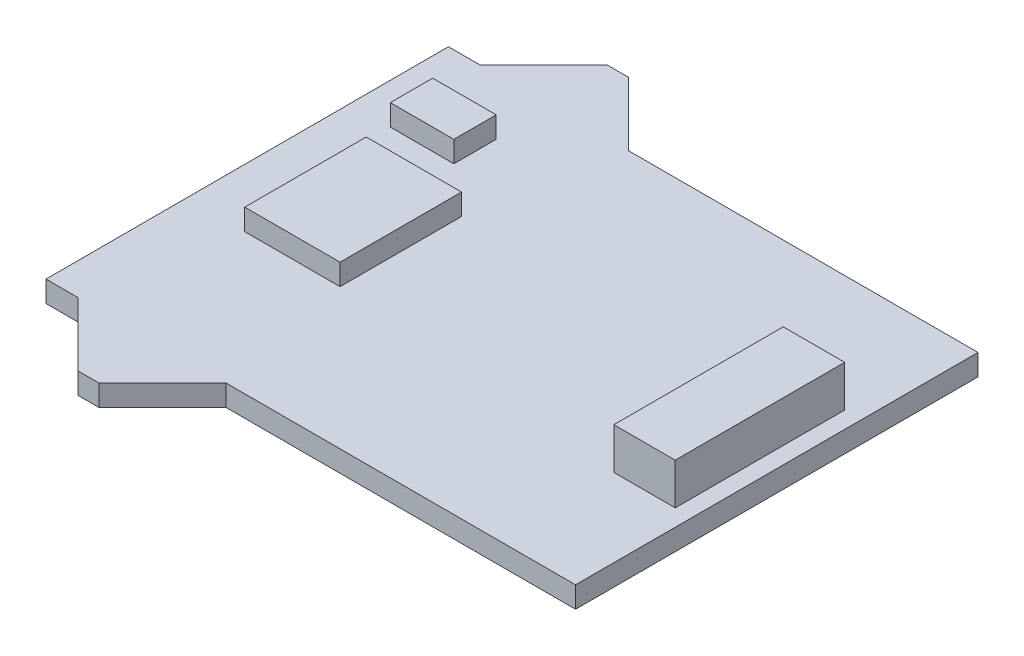
ISO-10303-21;
HEADER;
FILE_DESCRIPTION(('STEP AP214'),'2;1');
FILE_NAME('part.step','',(''),(''),'','','');
FILE_SCHEMA(('AUTOMOTIVE_DESIGN { 1 0 10303 214 1 1 1 1 }'));
ENDSEC;
DATA;
#1=APPLICATION_CONTEXT('core data for automotive mechanical design processes');
#2=APPLICATION_PROTOCOL_DEFINITION('international standard','automotive_design',2000,#1);
#3=PRODUCT_CONTEXT('',#1,'mechanical');
#4=PRODUCT('Part','Part','',(#3));
#5=PRODUCT_RELATED_PRODUCT_CATEGORY('part','',(#4));
#6=PRODUCT_DEFINITION_FORMATION('','',#4);
#7=PRODUCT_DEFINITION_CONTEXT('part definition',#1,'design');
#8=PRODUCT_DEFINITION('design','',#6,#7);
#9=PRODUCT_DEFINITION_SHAPE('','',#8);
#10=(LENGTH_UNIT() NAMED_UNIT(*) SI_UNIT(.MILLI.,.METRE.));
#11=(NAMED_UNIT(*) PLANE_ANGLE_UNIT() SI_UNIT($,.RADIAN.));
#12=(NAMED_UNIT(*) SI_UNIT($,.STERADIAN.) SOLID_ANGLE_UNIT());
#13=UNCERTAINTY_MEASURE_WITH_UNIT(LENGTH_MEASURE(1.E-05),#10,'distance_accuracy_value','');
#14=(GEOMETRIC_REPRESENTATION_CONTEXT(3) GLOBAL_UNCERTAINTY_ASSIGNED_CONTEXT((#13)) GLOBAL_UNIT_ASSIGNED_CONTEXT((#10,
#11,#12)) REPRESENTATION_CONTEXT('',''));
#15=CARTESIAN_POINT('',(0.,0.,0.));
#16=DIRECTION('',(0.,0.,1.));
#17=DIRECTION('',(1.,0.,0.));
#18=AXIS2_PLACEMENT_3D('',#15,#16,#17);
#19=CARTESIAN_POINT('',(0.,0.,0.));
#20=DIRECTION('',(0.,-1.,0.));
#21=DIRECTION('',(0.,0.,-1.));
#22=AXIS2_PLACEMENT_3D('',#19,#20,#21);
#23=PLANE('',#22);
#24=DIRECTION('',(0.,0.,-1.));
#25=VECTOR('',#24,1.);
#26=CARTESIAN_POINT('',(-0.0875000000000005,0.,-4.842));
#27=LINE('',#26,#25);
#28=CARTESIAN_POINT('',(-0.0875000000000005,0.,-4.842));
#29=VERTEX_POINT('',#28);
#30=CARTESIAN_POINT('',(-0.0875000000000008,0.,-6.842));
#31=VERTEX_POINT('',#30);
#32=EDGE_CURVE('E217',#29,#31,#27,.T.);
#33=ORIENTED_EDGE('',*,*,#32,.F.);
#34=DIRECTION('',(1.,0.,0.));
#35=VECTOR('',#34,1.);
#36=CARTESIAN_POINT('',(-3.0875,0.,-4.842));
#37=LINE('',#36,#35);
#38=CARTESIAN_POINT('',(-3.0875,0.,-4.842));
#39=VERTEX_POINT('',#38);
#40=EDGE_CURVE('E230',#39,#29,#37,.T.);
#41=ORIENTED_EDGE('',*,*,#40,.F.);
#42=DIRECTION('',(0.,0.,1.));
#43=VECTOR('',#42,1.);
#44=CARTESIAN_POINT('',(-3.0875,0.,-4.842));
#45=LINE('',#44,#43);
#46=CARTESIAN_POINT('',(-3.0875,0.,-6.842));
#47=VERTEX_POINT('',#46);
#48=EDGE_CURVE('E239',#47,#39,#45,.T.);
#49=ORIENTED_EDGE('',*,*,#48,.F.);
#50=DIRECTION('',(-1.,0.,0.));
#51=VECTOR('',#50,1.);
#52=CARTESIAN_POINT('',(-3.0875,0.,-6.842));
#53=LINE('',#52,#51);
#54=EDGE_CURVE('E220',#31,#47,#53,.T.);
#55=ORIENTED_EDGE('',*,*,#54,.F.);
#56=EDGE_LOOP('',(#33,#41,#49,#55));
#57=FACE_BOUND('',#56,.T.);
#58=DIRECTION('',(0.,0.,-1.));
#59=VECTOR('',#58,1.);
#60=CARTESIAN_POINT('',(20.000000132,0.,-9.50000005));
#61=LINE('',#60,#59);
#62=CARTESIAN_POINT('',(20.000000132,0.,9.50000005));
#63=VERTEX_POINT('',#62);
#64=CARTESIAN_POINT('',(20.000000132,0.,-9.50000005));
#65=VERTEX_POINT('',#64);
#66=EDGE_CURVE('E292',#63,#65,#61,.T.);
#67=ORIENTED_EDGE('',*,*,#66,.T.);
#68=DIRECTION('',(-1.,0.,0.));
#69=VECTOR('',#68,1.);
#70=CARTESIAN_POINT('',(3.499999985,0.,-9.50000005));
#71=LINE('',#70,#69);
#72=CARTESIAN_POINT('',(3.499999985,0.,-9.50000005));
#73=VERTEX_POINT('',#72);
#74=EDGE_CURVE('E288',#65,#73,#71,.T.);
#75=ORIENTED_EDGE('',*,*,#74,.T.);
#76=DIRECTION('',(-0.707106781186547,0.,-0.707106781186547));
#77=VECTOR('',#76,1.);
#78=CARTESIAN_POINT('',(0.499999888999999,0.,-12.500000146));
#79=LINE('',#78,#77);
#80=CARTESIAN_POINT('',(0.499999888999999,0.,-12.500000146));
#81=VERTEX_POINT('',#80);
#82=EDGE_CURVE('E326',#73,#81,#79,.T.);
#83=ORIENTED_EDGE('',*,*,#82,.T.);
#84=DIRECTION('',(-1.,0.,0.));
#85=VECTOR('',#84,1.);
#86=CARTESIAN_POINT('',(-0.499999888999999,0.,-12.500000146));
#87=LINE('',#86,#85);
#88=CARTESIAN_POINT('',(-0.499999888999999,0.,-12.500000146));
#89=VERTEX_POINT('',#88);
#90=EDGE_CURVE('E329',#81,#89,#87,.T.);
#91=ORIENTED_EDGE('',*,*,#90,.T.);
#92=DIRECTION('',(-0.707106781186547,0.,0.707106781186547));
#93=VECTOR('',#92,1.);
#94=CARTESIAN_POINT('',(-3.499999985,0.,-9.50000005));
#95=LINE('',#94,#93);
#96=CARTESIAN_POINT('',(-3.499999985,0.,-9.50000005));
#97=VERTEX_POINT('',#96);
#98=EDGE_CURVE('E332',#89,#97,#95,.T.);
#99=ORIENTED_EDGE('',*,*,#98,.T.);
#100=DIRECTION('',(-1.,0.,0.));
#101=VECTOR('',#100,1.);
#102=CARTESIAN_POINT('',(-4.999999906,0.,-9.50000005));
#103=LINE('',#102,#101);
#104=CARTESIAN_POINT('',(-4.999999906,0.,-9.50000005));
#105=VERTEX_POINT('',#104);
#106=EDGE_CURVE('E335',#97,#105,#103,.T.);
#107=ORIENTED_EDGE('',*,*,#106,.T.);
#108=DIRECTION('',(0.,0.,1.));
#109=VECTOR('',#108,1.);
#110=CARTESIAN_POINT('',(-4.999999906,0.,-9.50000005));
#111=LINE('',#110,#109);
#112=CARTESIAN_POINT('',(-4.999999906,0.,9.50000005));
#113=VERTEX_POINT('',#112);
#114=EDGE_CURVE('E338',#105,#113,#111,.T.);
#115=ORIENTED_EDGE('',*,*,#114,.T.);
#116=DIRECTION('',(1.,0.,0.));
#117=VECTOR('',#116,1.);
#118=CARTESIAN_POINT('',(-4.999999906,0.,9.50000005));
#119=LINE('',#118,#117);
#120=CARTESIAN_POINT('',(-3.499999985,0.,9.50000005));
#121=VERTEX_POINT('',#120);
#122=EDGE_CURVE('E341',#113,#121,#119,.T.);
#123=ORIENTED_EDGE('',*,*,#122,.T.);
#124=DIRECTION('',(0.707106781186547,0.,0.707106781186547));
#125=VECTOR('',#124,1.);
#126=CARTESIAN_POINT('',(-3.499999985,0.,9.50000005));
#127=LINE('',#126,#125);
#128=CARTESIAN_POINT('',(-0.499999888999999,0.,12.500000146));
#129=VERTEX_POINT('',#128);
#130=EDGE_CURVE('E344',#121,#129,#127,.T.);
#131=ORIENTED_EDGE('',*,*,#130,.T.);
#132=DIRECTION('',(1.,0.,0.));
#133=VECTOR('',#132,1.);
#134=CARTESIAN_POINT('',(-0.499999888999999,0.,12.500000146));
#135=LINE('',#134,#133);
#136=CARTESIAN_POINT('',(0.499999888999999,0.,12.500000146));
#137=VERTEX_POINT('',#136);
#138=EDGE_CURVE('E347',#129,#137,#135,.T.);
#139=ORIENTED_EDGE('',*,*,#138,.T.);
#140=DIRECTION('',(0.707106781186547,0.,-0.707106781186547));
#141=VECTOR('',#140,1.);
#142=CARTESIAN_POINT('',(0.499999888999999,0.,12.500000146));
#143=LINE('',#142,#141);
#144=CARTESIAN_POINT('',(3.499999985,0.,9.50000005));
#145=VERTEX_POINT('',#144);
#146=EDGE_CURVE('E350',#137,#145,#143,.T.);
#147=ORIENTED_EDGE('',*,*,#146,.T.);
#148=DIRECTION('',(1.,0.,0.));
#149=VECTOR('',#148,1.);
#150=CARTESIAN_POINT('',(4.999999906,0.,9.50000005));
#151=LINE('',#150,#149);
#152=EDGE_CURVE('E353',#145,#63,#151,.T.);
#153=ORIENTED_EDGE('',*,*,#152,.T.);
#154=EDGE_LOOP('',(#67,#75,#83,#91,#99,#107,#115,#123,#131,#139,#147,#153));
#155=FACE_BOUND('',#154,.T.);
#156=DIRECTION('',(0.,0.,-1.));
#157=VECTOR('',#156,1.);
#158=CARTESIAN_POINT('',(2.249999945,0.,2.86760421207147));
#159=LINE('',#158,#157);
#160=CARTESIAN_POINT('',(2.249999945,0.,2.86760421207147));
#161=VERTEX_POINT('',#160);
#162=CARTESIAN_POINT('',(2.249999945,0.,-2.86760421207147));
#163=VERTEX_POINT('',#162);
#164=EDGE_CURVE('E255',#161,#163,#159,.T.);
#165=ORIENTED_EDGE('',*,*,#164,.F.);
#166=DIRECTION('',(1.,0.,0.));
#167=VECTOR('',#166,1.);
#168=CARTESIAN_POINT('',(-2.249999945,0.,2.86760421207147));
#169=LINE('',#168,#167);
#170=CARTESIAN_POINT('',(-2.249999945,0.,2.86760421207147));
#171=VERTEX_POINT('',#170);
#172=EDGE_CURVE('E260',#171,#161,#169,.T.);
#173=ORIENTED_EDGE('',*,*,#172,.F.);
#174=DIRECTION('',(0.,0.,1.));
#175=VECTOR('',#174,1.);
#176=CARTESIAN_POINT('',(-2.249999945,0.,2.86760421207147));
#177=LINE('',#176,#175);
#178=CARTESIAN_POINT('',(-2.249999945,0.,-2.86760421207147));
#179=VERTEX_POINT('',#178);
#180=EDGE_CURVE('E272',#179,#171,#177,.T.);
#181=ORIENTED_EDGE('',*,*,#180,.F.);
#182=DIRECTION('',(-1.,0.,0.));
#183=VECTOR('',#182,1.);
#184=CARTESIAN_POINT('',(-2.249999945,0.,-2.86760421207147));
#185=LINE('',#184,#183);
#186=EDGE_CURVE('E269',#163,#179,#185,.T.);
#187=ORIENTED_EDGE('',*,*,#186,.F.);
#188=EDGE_LOOP('',(#165,#173,#181,#187));
#189=FACE_BOUND('',#188,.T.);
#190=DIRECTION('',(1.,0.,0.));
#191=VECTOR('',#190,1.);
#192=CARTESIAN_POINT('',(16.30625009,0.,4.000000001));
#193=LINE('',#192,#191);
#194=CARTESIAN_POINT('',(16.30625009,0.,4.000000001));
#195=VERTEX_POINT('',#194);
#196=CARTESIAN_POINT('',(19.206250132,0.,4.000000001));
#197=VERTEX_POINT('',#196);
#198=EDGE_CURVE('E216',#195,#197,#193,.T.);
#199=ORIENTED_EDGE('',*,*,#198,.F.);
#200=DIRECTION('',(0.,0.,1.));
#201=VECTOR('',#200,1.);
#202=CARTESIAN_POINT('',(16.30625009,0.,4.000000001));
#203=LINE('',#202,#201);
#204=CARTESIAN_POINT('',(16.30625009,0.,-4.000000001));
#205=VERTEX_POINT('',#204);
#206=EDGE_CURVE('E213',#205,#195,#203,.T.);
#207=ORIENTED_EDGE('',*,*,#206,.F.);
#208=DIRECTION('',(-1.,0.,0.));
#209=VECTOR('',#208,1.);
#210=CARTESIAN_POINT('',(16.30625009,0.,-4.000000001));
#211=LINE('',#210,#209);
#212=CARTESIAN_POINT('',(19.206250132,0.,-4.000000001));
#213=VERTEX_POINT('',#212);
#214=EDGE_CURVE('E55',#213,#205,#211,.T.);
#215=ORIENTED_EDGE('',*,*,#214,.F.);
#216=DIRECTION('',(0.,0.,-1.));
#217=VECTOR('',#216,1.);
#218=CARTESIAN_POINT('',(19.206250132,0.,4.000000001));
#219=LINE('',#218,#217);
#220=EDGE_CURVE('E50',#197,#213,#219,.T.);
#221=ORIENTED_EDGE('',*,*,#220,.F.);
#222=EDGE_LOOP('',(#199,#207,#215,#221));
#223=FACE_BOUND('',#222,.T.);
#224=ADVANCED_FACE('F33',(#57,#155,#189,#223),#23,.F.);
#225=CARTESIAN_POINT('',(20.000000132,-1.000000032,-9.50000005));
#226=DIRECTION('',(1.,0.,0.));
#227=DIRECTION('',(0.,0.,-1.));
#228=AXIS2_PLACEMENT_3D('',#225,#226,#227);
#229=PLANE('',#228);
#230=ORIENTED_EDGE('',*,*,#66,.F.);
#231=DIRECTION('',(0.,1.,0.));
#232=VECTOR('',#231,1.);
#233=CARTESIAN_POINT('',(20.000000132,-1.000000032,9.50000005));
#234=LINE('',#233,#232);
#235=CARTESIAN_POINT('',(20.000000132,-1.000000032,9.50000005));
#236=VERTEX_POINT('',#235);
#237=EDGE_CURVE('E42',#236,#63,#234,.T.);
#238=ORIENTED_EDGE('',*,*,#237,.F.);
#239=DIRECTION('',(0.,0.,-1.));
#240=VECTOR('',#239,1.);
#241=CARTESIAN_POINT('',(20.000000132,-1.000000032,-9.50000005));
#242=LINE('',#241,#240);
#243=CARTESIAN_POINT('',(20.000000132,-1.000000032,-9.50000005));
#244=VERTEX_POINT('',#243);
#245=EDGE_CURVE('E321',#236,#244,#242,.T.);
#246=ORIENTED_EDGE('',*,*,#245,.T.);
#247=DIRECTION('',(0.,1.,0.));
#248=VECTOR('',#247,1.);
#249=CARTESIAN_POINT('',(20.000000132,-1.000000032,-9.50000005));
#250=LINE('',#249,#248);
#251=EDGE_CURVE('E11',#244,#65,#250,.T.);
#252=ORIENTED_EDGE('',*,*,#251,.T.);
#253=EDGE_LOOP('',(#230,#238,#246,#252));
#254=FACE_BOUND('',#253,.T.);
#255=ADVANCED_FACE('F389',(#254),#229,.T.);
#256=CARTESIAN_POINT('',(4.999999906,-1.000000032,9.50000005));
#257=DIRECTION('',(0.,0.,1.));
#258=DIRECTION('',(1.,0.,0.));
#259=AXIS2_PLACEMENT_3D('',#256,#257,#258);
#260=PLANE('',#259);
#261=ORIENTED_EDGE('',*,*,#152,.F.);
#262=DIRECTION('',(0.,1.,0.));
#263=VECTOR('',#262,1.);
#264=CARTESIAN_POINT('',(3.499999985,-1.000000032,9.50000005));
#265=LINE('',#264,#263);
#266=CARTESIAN_POINT('',(3.499999985,-1.000000032,9.50000005));
#267=VERTEX_POINT('',#266);
#268=EDGE_CURVE('E359',#267,#145,#265,.T.);
#269=ORIENTED_EDGE('',*,*,#268,.F.);
#270=DIRECTION('',(1.,0.,0.));
#271=VECTOR('',#270,1.);
#272=CARTESIAN_POINT('',(3.499999985,-1.000000032,9.50000005));
#273=LINE('',#272,#271);
#274=EDGE_CURVE('E319',#267,#236,#273,.T.);
#275=ORIENTED_EDGE('',*,*,#274,.T.);
#276=ORIENTED_EDGE('',*,*,#237,.T.);
#277=EDGE_LOOP('',(#261,#269,#275,#276));
#278=FACE_BOUND('',#277,.T.);
#279=ADVANCED_FACE('F426',(#278),#260,.T.);
#280=CARTESIAN_POINT('',(0.499999888999999,-1.000000032,12.500000146));
#281=DIRECTION('',(0.707106781186547,0.,0.707106781186548));
#282=DIRECTION('',(0.707106781186548,0.,-0.707106781186547));
#283=AXIS2_PLACEMENT_3D('',#280,#281,#282);
#284=PLANE('',#283);
#285=ORIENTED_EDGE('',*,*,#146,.F.);
#286=DIRECTION('',(0.,1.,0.));
#287=VECTOR('',#286,1.);
#288=CARTESIAN_POINT('',(0.499999888999999,-1.000000032,12.500000146));
#289=LINE('',#288,#287);
#290=CARTESIAN_POINT('',(0.499999888999999,-1.000000032,12.500000146));
#291=VERTEX_POINT('',#290);
#292=EDGE_CURVE('E362',#291,#137,#289,.T.);
#293=ORIENTED_EDGE('',*,*,#292,.F.);
#294=DIRECTION('',(0.707106781186547,0.,-0.707106781186547));
#295=VECTOR('',#294,1.);
#296=CARTESIAN_POINT('',(0.499999888999999,-1.000000032,12.500000146));
#297=LINE('',#296,#295);
#298=EDGE_CURVE('E316',#291,#267,#297,.T.);
#299=ORIENTED_EDGE('',*,*,#298,.T.);
#300=ORIENTED_EDGE('',*,*,#268,.T.);
#301=EDGE_LOOP('',(#285,#293,#299,#300));
#302=FACE_BOUND('',#301,.T.);
#303=ADVANCED_FACE('F423',(#302),#284,.T.);
#304=CARTESIAN_POINT('',(-0.499999888999999,-1.000000032,12.500000146));
#305=DIRECTION('',(0.,0.,1.));
#306=DIRECTION('',(1.,0.,0.));
#307=AXIS2_PLACEMENT_3D('',#304,#305,#306);
#308=PLANE('',#307);
#309=ORIENTED_EDGE('',*,*,#138,.F.);
#310=DIRECTION('',(0.,1.,0.));
#311=VECTOR('',#310,1.);
#312=CARTESIAN_POINT('',(-0.499999888999999,-1.000000032,12.500000146));
#313=LINE('',#312,#311);
#314=CARTESIAN_POINT('',(-0.499999888999999,-1.000000032,12.500000146));
#315=VERTEX_POINT('',#314);
#316=EDGE_CURVE('E364',#315,#129,#313,.T.);
#317=ORIENTED_EDGE('',*,*,#316,.F.);
#318=DIRECTION('',(1.,0.,0.));
#319=VECTOR('',#318,1.);
#320=CARTESIAN_POINT('',(-0.499999888999999,-1.000000032,12.500000146));
#321=LINE('',#320,#319);
#322=EDGE_CURVE('E313',#315,#291,#321,.T.);
#323=ORIENTED_EDGE('',*,*,#322,.T.);
#324=ORIENTED_EDGE('',*,*,#292,.T.);
#325=EDGE_LOOP('',(#309,#317,#323,#324));
#326=FACE_BOUND('',#325,.T.);
#327=ADVANCED_FACE('F420',(#326),#308,.T.);
#328=CARTESIAN_POINT('',(-3.499999985,-1.000000032,9.50000005));
#329=DIRECTION('',(-0.707106781186547,0.,0.707106781186548));
#330=DIRECTION('',(0.707106781186548,0.,0.707106781186547));
#331=AXIS2_PLACEMENT_3D('',#328,#329,#330);
#332=PLANE('',#331);
#333=ORIENTED_EDGE('',*,*,#130,.F.);
#334=DIRECTION('',(0.,1.,0.));
#335=VECTOR('',#334,1.);
#336=CARTESIAN_POINT('',(-3.499999985,-1.000000032,9.50000005));
#337=LINE('',#336,#335);
#338=CARTESIAN_POINT('',(-3.499999985,-1.000000032,9.50000005));
#339=VERTEX_POINT('',#338);
#340=EDGE_CURVE('E366',#339,#121,#337,.T.);
#341=ORIENTED_EDGE('',*,*,#340,.F.);
#342=DIRECTION('',(0.707106781186547,0.,0.707106781186547));
#343=VECTOR('',#342,1.);
#344=CARTESIAN_POINT('',(-3.499999985,-1.000000032,9.50000005));
#345=LINE('',#344,#343);
#346=EDGE_CURVE('E310',#339,#315,#345,.T.);
#347=ORIENTED_EDGE('',*,*,#346,.T.);
#348=ORIENTED_EDGE('',*,*,#316,.T.);
#349=EDGE_LOOP('',(#333,#341,#347,#348));
#350=FACE_BOUND('',#349,.T.);
#351=ADVANCED_FACE('F416',(#350),#332,.T.);
#352=CARTESIAN_POINT('',(-4.999999906,-1.000000032,9.50000005));
#353=DIRECTION('',(0.,0.,1.));
#354=DIRECTION('',(1.,0.,0.));
#355=AXIS2_PLACEMENT_3D('',#352,#353,#354);
#356=PLANE('',#355);
#357=ORIENTED_EDGE('',*,*,#122,.F.);
#358=DIRECTION('',(0.,1.,0.));
#359=VECTOR('',#358,1.);
#360=CARTESIAN_POINT('',(-4.999999906,-1.000000032,9.50000005));
#361=LINE('',#360,#359);
#362=CARTESIAN_POINT('',(-4.999999906,-1.000000032,9.50000005));
#363=VERTEX_POINT('',#362);
#364=EDGE_CURVE('E368',#363,#113,#361,.T.);
#365=ORIENTED_EDGE('',*,*,#364,.F.);
#366=DIRECTION('',(1.,0.,0.));
#367=VECTOR('',#366,1.);
#368=CARTESIAN_POINT('',(-4.999999906,-1.000000032,9.50000005));
#369=LINE('',#368,#367);
#370=EDGE_CURVE('E307',#363,#339,#369,.T.);
#371=ORIENTED_EDGE('',*,*,#370,.T.);
#372=ORIENTED_EDGE('',*,*,#340,.T.);
#373=EDGE_LOOP('',(#357,#365,#371,#372));
#374=FACE_BOUND('',#373,.T.);
#375=ADVANCED_FACE('F412',(#374),#356,.T.);
#376=CARTESIAN_POINT('',(-4.999999906,-1.000000032,-9.50000005));
#377=DIRECTION('',(-1.,0.,0.));
#378=DIRECTION('',(0.,0.,1.));
#379=AXIS2_PLACEMENT_3D('',#376,#377,#378);
#380=PLANE('',#379);
#381=ORIENTED_EDGE('',*,*,#114,.F.);
#382=DIRECTION('',(0.,1.,0.));
#383=VECTOR('',#382,1.);
#384=CARTESIAN_POINT('',(-4.999999906,-1.000000032,-9.50000005));
#385=LINE('',#384,#383);
#386=CARTESIAN_POINT('',(-4.999999906,-1.000000032,-9.50000005));
#387=VERTEX_POINT('',#386);
#388=EDGE_CURVE('E370',#387,#105,#385,.T.);
#389=ORIENTED_EDGE('',*,*,#388,.F.);
#390=DIRECTION('',(0.,0.,1.));
#391=VECTOR('',#390,1.);
#392=CARTESIAN_POINT('',(-4.999999906,-1.000000032,-9.50000005));
#393=LINE('',#392,#391);
#394=EDGE_CURVE('E304',#387,#363,#393,.T.);
#395=ORIENTED_EDGE('',*,*,#394,.T.);
#396=ORIENTED_EDGE('',*,*,#364,.T.);
#397=EDGE_LOOP('',(#381,#389,#395,#396));
#398=FACE_BOUND('',#397,.T.);
#399=ADVANCED_FACE('F408',(#398),#380,.T.);
#400=CARTESIAN_POINT('',(-4.999999906,-1.000000032,-9.50000005));
#401=DIRECTION('',(0.,0.,-1.));
#402=DIRECTION('',(-1.,0.,0.));
#403=AXIS2_PLACEMENT_3D('',#400,#401,#402);
#404=PLANE('',#403);
#405=ORIENTED_EDGE('',*,*,#106,.F.);
#406=DIRECTION('',(0.,1.,0.));
#407=VECTOR('',#406,1.);
#408=CARTESIAN_POINT('',(-3.499999985,-1.000000032,-9.50000005));
#409=LINE('',#408,#407);
#410=CARTESIAN_POINT('',(-3.499999985,-1.000000032,-9.50000005));
#411=VERTEX_POINT('',#410);
#412=EDGE_CURVE('E372',#411,#97,#409,.T.);
#413=ORIENTED_EDGE('',*,*,#412,.F.);
#414=DIRECTION('',(-1.,0.,0.));
#415=VECTOR('',#414,1.);
#416=CARTESIAN_POINT('',(-4.999999906,-1.000000032,-9.50000005));
#417=LINE('',#416,#415);
#418=EDGE_CURVE('E301',#411,#387,#417,.T.);
#419=ORIENTED_EDGE('',*,*,#418,.T.);
#420=ORIENTED_EDGE('',*,*,#388,.T.);
#421=EDGE_LOOP('',(#405,#413,#419,#420));
#422=FACE_BOUND('',#421,.T.);
#423=ADVANCED_FACE('F404',(#422),#404,.T.);
#424=CARTESIAN_POINT('',(-3.499999985,-1.000000032,-9.50000005));
#425=DIRECTION('',(-0.707106781186547,0.,-0.707106781186548));
#426=DIRECTION('',(-0.707106781186548,0.,0.707106781186547));
#427=AXIS2_PLACEMENT_3D('',#424,#425,#426);
#428=PLANE('',#427);
#429=ORIENTED_EDGE('',*,*,#98,.F.);
#430=DIRECTION('',(0.,1.,0.));
#431=VECTOR('',#430,1.);
#432=CARTESIAN_POINT('',(-0.499999888999999,-1.000000032,-12.500000146));
#433=LINE('',#432,#431);
#434=CARTESIAN_POINT('',(-0.499999888999999,-1.000000032,-12.500000146));
#435=VERTEX_POINT('',#434);
#436=EDGE_CURVE('E374',#435,#89,#433,.T.);
#437=ORIENTED_EDGE('',*,*,#436,.F.);
#438=DIRECTION('',(-0.707106781186547,0.,0.707106781186547));
#439=VECTOR('',#438,1.);
#440=CARTESIAN_POINT('',(-3.499999985,-1.000000032,-9.50000005));
#441=LINE('',#440,#439);
#442=EDGE_CURVE('E298',#435,#411,#441,.T.);
#443=ORIENTED_EDGE('',*,*,#442,.T.);
#444=ORIENTED_EDGE('',*,*,#412,.T.);
#445=EDGE_LOOP('',(#429,#437,#443,#444));
#446=FACE_BOUND('',#445,.T.);
#447=ADVANCED_FACE('F402',(#446),#428,.T.);
#448=CARTESIAN_POINT('',(-0.499999888999999,-1.000000032,-12.500000146));
#449=DIRECTION('',(0.,0.,-1.));
#450=DIRECTION('',(-1.,0.,0.));
#451=AXIS2_PLACEMENT_3D('',#448,#449,#450);
#452=PLANE('',#451);
#453=ORIENTED_EDGE('',*,*,#90,.F.);
#454=DIRECTION('',(0.,1.,0.));
#455=VECTOR('',#454,1.);
#456=CARTESIAN_POINT('',(0.499999888999999,-1.000000032,-12.500000146));
#457=LINE('',#456,#455);
#458=CARTESIAN_POINT('',(0.499999888999999,-1.000000032,-12.500000146));
#459=VERTEX_POINT('',#458);
#460=EDGE_CURVE('E375',#459,#81,#457,.T.);
#461=ORIENTED_EDGE('',*,*,#460,.F.);
#462=DIRECTION('',(-1.,0.,0.));
#463=VECTOR('',#462,1.);
#464=CARTESIAN_POINT('',(-0.499999888999999,-1.000000032,-12.500000146));
#465=LINE('',#464,#463);
#466=EDGE_CURVE('E295',#459,#435,#465,.T.);
#467=ORIENTED_EDGE('',*,*,#466,.T.);
#468=ORIENTED_EDGE('',*,*,#436,.T.);
#469=EDGE_LOOP('',(#453,#461,#467,#468));
#470=FACE_BOUND('',#469,.T.);
#471=ADVANCED_FACE('F398',(#470),#452,.T.);
#472=CARTESIAN_POINT('',(0.499999888999999,-1.000000032,-12.500000146));
#473=DIRECTION('',(0.707106781186547,0.,-0.707106781186548));
#474=DIRECTION('',(-0.707106781186548,0.,-0.707106781186547));
#475=AXIS2_PLACEMENT_3D('',#472,#473,#474);
#476=PLANE('',#475);
#477=ORIENTED_EDGE('',*,*,#82,.F.);
#478=DIRECTION('',(0.,1.,0.));
#479=VECTOR('',#478,1.);
#480=CARTESIAN_POINT('',(3.499999985,-1.000000032,-9.50000005));
#481=LINE('',#480,#479);
#482=CARTESIAN_POINT('',(3.499999985,-1.000000032,-9.50000005));
#483=VERTEX_POINT('',#482);
#484=EDGE_CURVE('E37',#483,#73,#481,.T.);
#485=ORIENTED_EDGE('',*,*,#484,.F.);
#486=DIRECTION('',(-0.707106781186547,0.,-0.707106781186547));
#487=VECTOR('',#486,1.);
#488=CARTESIAN_POINT('',(0.499999888999999,-1.000000032,-12.500000146));
#489=LINE('',#488,#487);
#490=EDGE_CURVE('E291',#483,#459,#489,.T.);
#491=ORIENTED_EDGE('',*,*,#490,.T.);
#492=ORIENTED_EDGE('',*,*,#460,.T.);
#493=EDGE_LOOP('',(#477,#485,#491,#492));
#494=FACE_BOUND('',#493,.T.);
#495=ADVANCED_FACE('F383',(#494),#476,.T.);
#496=CARTESIAN_POINT('',(3.499999985,-1.000000032,-9.50000005));
#497=DIRECTION('',(0.,0.,-1.));
#498=DIRECTION('',(-1.,0.,0.));
#499=AXIS2_PLACEMENT_3D('',#496,#497,#498);
#500=PLANE('',#499);
#501=ORIENTED_EDGE('',*,*,#74,.F.);
#502=ORIENTED_EDGE('',*,*,#251,.F.);
#503=DIRECTION('',(-1.,0.,0.));
#504=VECTOR('',#503,1.);
#505=CARTESIAN_POINT('',(4.999999906,-1.000000032,-9.50000005));
#506=LINE('',#505,#504);
#507=EDGE_CURVE('E289',#244,#483,#506,.T.);
#508=ORIENTED_EDGE('',*,*,#507,.T.);
#509=ORIENTED_EDGE('',*,*,#484,.T.);
#510=EDGE_LOOP('',(#501,#502,#508,#509));
#511=FACE_BOUND('',#510,.T.);
#512=ADVANCED_FACE('F35',(#511),#500,.T.);
#513=CARTESIAN_POINT('',(0.,-1.000000032,0.));
#514=DIRECTION('',(0.,-1.,0.));
#515=DIRECTION('',(0.,0.,-1.));
#516=AXIS2_PLACEMENT_3D('',#513,#514,#515);
#517=PLANE('',#516);
#518=ORIENTED_EDGE('',*,*,#507,.F.);
#519=ORIENTED_EDGE('',*,*,#245,.F.);
#520=ORIENTED_EDGE('',*,*,#274,.F.);
#521=ORIENTED_EDGE('',*,*,#298,.F.);
#522=ORIENTED_EDGE('',*,*,#322,.F.);
#523=ORIENTED_EDGE('',*,*,#346,.F.);
#524=ORIENTED_EDGE('',*,*,#370,.F.);
#525=ORIENTED_EDGE('',*,*,#394,.F.);
#526=ORIENTED_EDGE('',*,*,#418,.F.);
#527=ORIENTED_EDGE('',*,*,#442,.F.);
#528=ORIENTED_EDGE('',*,*,#466,.F.);
#529=ORIENTED_EDGE('',*,*,#490,.F.);
#530=EDGE_LOOP('',(#518,#519,#520,#521,#522,#523,#524,#525,#526,#527,#528,#529));
#531=FACE_BOUND('',#530,.T.);
#532=ADVANCED_FACE('F392',(#531),#517,.T.);
#533=CARTESIAN_POINT('',(2.249999945,1.,2.86760421207147));
#534=DIRECTION('',(-1.,0.,0.));
#535=DIRECTION('',(0.,0.,1.));
#536=AXIS2_PLACEMENT_3D('',#533,#534,#535);
#537=PLANE('',#536);
#538=ORIENTED_EDGE('',*,*,#164,.T.);
#539=DIRECTION('',(0.,-1.,0.));
#540=VECTOR('',#539,1.);
#541=CARTESIAN_POINT('',(2.249999945,1.,-2.86760421207147));
#542=LINE('',#541,#540);
#543=CARTESIAN_POINT('',(2.249999945,1.,-2.86760421207147));
#544=VERTEX_POINT('',#543);
#545=EDGE_CURVE('E285',#544,#163,#542,.T.);
#546=ORIENTED_EDGE('',*,*,#545,.F.);
#547=DIRECTION('',(0.,0.,-1.));
#548=VECTOR('',#547,1.);
#549=CARTESIAN_POINT('',(2.249999945,1.,2.86760421207147));
#550=LINE('',#549,#548);
#551=CARTESIAN_POINT('',(2.249999945,1.,2.86760421207147));
#552=VERTEX_POINT('',#551);
#553=EDGE_CURVE('E256',#552,#544,#550,.T.);
#554=ORIENTED_EDGE('',*,*,#553,.F.);
#555=DIRECTION('',(0.,-1.,0.));
#556=VECTOR('',#555,1.);
#557=CARTESIAN_POINT('',(2.249999945,1.,2.86760421207147));
#558=LINE('',#557,#556);
#559=EDGE_CURVE('E266',#552,#161,#558,.T.);
#560=ORIENTED_EDGE('',*,*,#559,.T.);
#561=EDGE_LOOP('',(#538,#546,#554,#560));
#562=FACE_BOUND('',#561,.T.);
#563=ADVANCED_FACE('F443',(#562),#537,.F.);
#564=CARTESIAN_POINT('',(-2.249999945,1.,-2.86760421207147));
#565=DIRECTION('',(0.,0.,1.));
#566=DIRECTION('',(1.,0.,0.));
#567=AXIS2_PLACEMENT_3D('',#564,#565,#566);
#568=PLANE('',#567);
#569=ORIENTED_EDGE('',*,*,#186,.T.);
#570=DIRECTION('',(0.,-1.,0.));
#571=VECTOR('',#570,1.);
#572=CARTESIAN_POINT('',(-2.249999945,1.,-2.86760421207147));
#573=LINE('',#572,#571);
#574=CARTESIAN_POINT('',(-2.249999945,1.,-2.86760421207147));
#575=VERTEX_POINT('',#574);
#576=EDGE_CURVE('E282',#575,#179,#573,.T.);
#577=ORIENTED_EDGE('',*,*,#576,.F.);
#578=DIRECTION('',(-1.,0.,0.));
#579=VECTOR('',#578,1.);
#580=CARTESIAN_POINT('',(-2.249999945,1.,-2.86760421207147));
#581=LINE('',#580,#579);
#582=EDGE_CURVE('E259',#544,#575,#581,.T.);
#583=ORIENTED_EDGE('',*,*,#582,.F.);
#584=ORIENTED_EDGE('',*,*,#545,.T.);
#585=EDGE_LOOP('',(#569,#577,#583,#584));
#586=FACE_BOUND('',#585,.T.);
#587=ADVANCED_FACE('F446',(#586),#568,.F.);
#588=CARTESIAN_POINT('',(-2.249999945,1.,2.86760421207147));
#589=DIRECTION('',(1.,0.,0.));
#590=DIRECTION('',(0.,0.,-1.));
#591=AXIS2_PLACEMENT_3D('',#588,#589,#590);
#592=PLANE('',#591);
#593=ORIENTED_EDGE('',*,*,#180,.T.);
#594=DIRECTION('',(0.,-1.,0.));
#595=VECTOR('',#594,1.);
#596=CARTESIAN_POINT('',(-2.249999945,1.,2.86760421207147));
#597=LINE('',#596,#595);
#598=CARTESIAN_POINT('',(-2.249999945,1.,2.86760421207147));
#599=VERTEX_POINT('',#598);
#600=EDGE_CURVE('E279',#599,#171,#597,.T.);
#601=ORIENTED_EDGE('',*,*,#600,.F.);
#602=DIRECTION('',(0.,0.,1.));
#603=VECTOR('',#602,1.);
#604=CARTESIAN_POINT('',(-2.249999945,1.,2.86760421207147));
#605=LINE('',#604,#603);
#606=EDGE_CURVE('E262',#575,#599,#605,.T.);
#607=ORIENTED_EDGE('',*,*,#606,.F.);
#608=ORIENTED_EDGE('',*,*,#576,.T.);
#609=EDGE_LOOP('',(#593,#601,#607,#608));
#610=FACE_BOUND('',#609,.T.);
#611=ADVANCED_FACE('F450',(#610),#592,.F.);
#612=CARTESIAN_POINT('',(-2.249999945,1.,2.86760421207147));
#613=DIRECTION('',(0.,0.,-1.));
#614=DIRECTION('',(-1.,0.,0.));
#615=AXIS2_PLACEMENT_3D('',#612,#613,#614);
#616=PLANE('',#615);
#617=ORIENTED_EDGE('',*,*,#172,.T.);
#618=ORIENTED_EDGE('',*,*,#559,.F.);
#619=DIRECTION('',(1.,0.,0.));
#620=VECTOR('',#619,1.);
#621=CARTESIAN_POINT('',(-2.249999945,1.,2.86760421207147));
#622=LINE('',#621,#620);
#623=EDGE_CURVE('E264',#599,#552,#622,.T.);
#624=ORIENTED_EDGE('',*,*,#623,.F.);
#625=ORIENTED_EDGE('',*,*,#600,.T.);
#626=EDGE_LOOP('',(#617,#618,#624,#625));
#627=FACE_BOUND('',#626,.T.);
#628=ADVANCED_FACE('F454',(#627),#616,.F.);
#629=CARTESIAN_POINT('',(0.,1.,0.));
#630=DIRECTION('',(0.,-1.,0.));
#631=DIRECTION('',(0.,0.,-1.));
#632=AXIS2_PLACEMENT_3D('',#629,#630,#631);
#633=PLANE('',#632);
#634=ORIENTED_EDGE('',*,*,#553,.T.);
#635=ORIENTED_EDGE('',*,*,#582,.T.);
#636=ORIENTED_EDGE('',*,*,#606,.T.);
#637=ORIENTED_EDGE('',*,*,#623,.T.);
#638=EDGE_LOOP('',(#634,#635,#636,#637));
#639=FACE_BOUND('',#638,.T.);
#640=ADVANCED_FACE('F458',(#639),#633,.F.);
#641=CARTESIAN_POINT('',(-0.0875000000000005,1.,-4.842));
#642=DIRECTION('',(-1.,0.,0.));
#643=DIRECTION('',(0.,0.,1.));
#644=AXIS2_PLACEMENT_3D('',#641,#642,#643);
#645=PLANE('',#644);
#646=ORIENTED_EDGE('',*,*,#32,.T.);
#647=DIRECTION('',(0.,-1.,0.));
#648=VECTOR('',#647,1.);
#649=CARTESIAN_POINT('',(-0.0875000000000008,1.,-6.842));
#650=LINE('',#649,#648);
#651=CARTESIAN_POINT('',(-0.0875000000000008,1.,-6.842));
#652=VERTEX_POINT('',#651);
#653=EDGE_CURVE('E252',#652,#31,#650,.T.);
#654=ORIENTED_EDGE('',*,*,#653,.F.);
#655=DIRECTION('',(0.,0.,-1.));
#656=VECTOR('',#655,1.);
#657=CARTESIAN_POINT('',(-0.0875000000000005,1.,-4.842));
#658=LINE('',#657,#656);
#659=CARTESIAN_POINT('',(-0.0875000000000005,1.,-4.842));
#660=VERTEX_POINT('',#659);
#661=EDGE_CURVE('E226',#660,#652,#658,.T.);
#662=ORIENTED_EDGE('',*,*,#661,.F.);
#663=DIRECTION('',(0.,-1.,0.));
#664=VECTOR('',#663,1.);
#665=CARTESIAN_POINT('',(-0.0875000000000005,1.,-4.842));
#666=LINE('',#665,#664);
#667=EDGE_CURVE('E235',#660,#29,#666,.T.);
#668=ORIENTED_EDGE('',*,*,#667,.T.);
#669=EDGE_LOOP('',(#646,#654,#662,#668));
#670=FACE_BOUND('',#669,.T.);
#671=ADVANCED_FACE('F462',(#670),#645,.F.);
#672=CARTESIAN_POINT('',(-3.0875,1.,-6.842));
#673=DIRECTION('',(0.,0.,1.));
#674=DIRECTION('',(1.,0.,0.));
#675=AXIS2_PLACEMENT_3D('',#672,#673,#674);
#676=PLANE('',#675);
#677=ORIENTED_EDGE('',*,*,#54,.T.);
#678=DIRECTION('',(0.,-1.,0.));
#679=VECTOR('',#678,1.);
#680=CARTESIAN_POINT('',(-3.0875,1.,-6.842));
#681=LINE('',#680,#679);
#682=CARTESIAN_POINT('',(-3.0875,1.,-6.842));
#683=VERTEX_POINT('',#682);
#684=EDGE_CURVE('E249',#683,#47,#681,.T.);
#685=ORIENTED_EDGE('',*,*,#684,.F.);
#686=DIRECTION('',(-1.,0.,0.));
#687=VECTOR('',#686,1.);
#688=CARTESIAN_POINT('',(-3.0875,1.,-6.842));
#689=LINE('',#688,#687);
#690=EDGE_CURVE('E229',#652,#683,#689,.T.);
#691=ORIENTED_EDGE('',*,*,#690,.F.);
#692=ORIENTED_EDGE('',*,*,#653,.T.);
#693=EDGE_LOOP('',(#677,#685,#691,#692));
#694=FACE_BOUND('',#693,.T.);
#695=ADVANCED_FACE('F466',(#694),#676,.F.);
#696=CARTESIAN_POINT('',(-3.0875,1.,-4.842));
#697=DIRECTION('',(1.,0.,0.));
#698=DIRECTION('',(0.,0.,-1.));
#699=AXIS2_PLACEMENT_3D('',#696,#697,#698);
#700=PLANE('',#699);
#701=ORIENTED_EDGE('',*,*,#48,.T.);
#702=DIRECTION('',(0.,-1.,0.));
#703=VECTOR('',#702,1.);
#704=CARTESIAN_POINT('',(-3.0875,1.,-4.842));
#705=LINE('',#704,#703);
#706=CARTESIAN_POINT('',(-3.0875,1.,-4.842));
#707=VERTEX_POINT('',#706);
#708=EDGE_CURVE('E246',#707,#39,#705,.T.);
#709=ORIENTED_EDGE('',*,*,#708,.F.);
#710=DIRECTION('',(0.,0.,1.));
#711=VECTOR('',#710,1.);
#712=CARTESIAN_POINT('',(-3.0875,1.,-4.842));
#713=LINE('',#712,#711);
#714=EDGE_CURVE('E232',#683,#707,#713,.T.);
#715=ORIENTED_EDGE('',*,*,#714,.F.);
#716=ORIENTED_EDGE('',*,*,#684,.T.);
#717=EDGE_LOOP('',(#701,#709,#715,#716));
#718=FACE_BOUND('',#717,.T.);
#719=ADVANCED_FACE('F470',(#718),#700,.F.);
#720=CARTESIAN_POINT('',(-3.0875,1.,-4.842));
#721=DIRECTION('',(0.,0.,-1.));
#722=DIRECTION('',(-1.,0.,0.));
#723=AXIS2_PLACEMENT_3D('',#720,#721,#722);
#724=PLANE('',#723);
#725=ORIENTED_EDGE('',*,*,#40,.T.);
#726=ORIENTED_EDGE('',*,*,#667,.F.);
#727=DIRECTION('',(1.,0.,0.));
#728=VECTOR('',#727,1.);
#729=CARTESIAN_POINT('',(-3.0875,1.,-4.842));
#730=LINE('',#729,#728);
#731=EDGE_CURVE('E234',#707,#660,#730,.T.);
#732=ORIENTED_EDGE('',*,*,#731,.F.);
#733=ORIENTED_EDGE('',*,*,#708,.T.);
#734=EDGE_LOOP('',(#725,#726,#732,#733));
#735=FACE_BOUND('',#734,.T.);
#736=ADVANCED_FACE('F474',(#735),#724,.F.);
#737=CARTESIAN_POINT('',(0.,1.,0.));
#738=DIRECTION('',(0.,-1.,0.));
#739=DIRECTION('',(0.,0.,-1.));
#740=AXIS2_PLACEMENT_3D('',#737,#738,#739);
#741=PLANE('',#740);
#742=ORIENTED_EDGE('',*,*,#661,.T.);
#743=ORIENTED_EDGE('',*,*,#690,.T.);
#744=ORIENTED_EDGE('',*,*,#714,.T.);
#745=ORIENTED_EDGE('',*,*,#731,.T.);
#746=EDGE_LOOP('',(#742,#743,#744,#745));
#747=FACE_BOUND('',#746,.T.);
#748=ADVANCED_FACE('F478',(#747),#741,.F.);
#749=CARTESIAN_POINT('',(16.30625009,1.94999991,4.000000001));
#750=DIRECTION('',(0.,0.,-1.));
#751=DIRECTION('',(-1.,0.,0.));
#752=AXIS2_PLACEMENT_3D('',#749,#750,#751);
#753=PLANE('',#752);
#754=ORIENTED_EDGE('',*,*,#198,.T.);
#755=DIRECTION('',(0.,-1.,0.));
#756=VECTOR('',#755,1.);
#757=CARTESIAN_POINT('',(19.206250132,1.94999991,4.000000001));
#758=LINE('',#757,#756);
#759=CARTESIAN_POINT('',(19.206250132,1.94999991,4.000000001));
#760=VERTEX_POINT('',#759);
#761=EDGE_CURVE('E197',#760,#197,#758,.T.);
#762=ORIENTED_EDGE('',*,*,#761,.F.);
#763=DIRECTION('',(1.,0.,0.));
#764=VECTOR('',#763,1.);
#765=CARTESIAN_POINT('',(16.30625009,1.94999991,4.000000001));
#766=LINE('',#765,#764);
#767=CARTESIAN_POINT('',(16.30625009,1.94999991,4.000000001));
#768=VERTEX_POINT('',#767);
#769=EDGE_CURVE('E204',#768,#760,#766,.T.);
#770=ORIENTED_EDGE('',*,*,#769,.F.);
#771=DIRECTION('',(0.,-1.,0.));
#772=VECTOR('',#771,1.);
#773=CARTESIAN_POINT('',(16.30625009,1.94999991,4.000000001));
#774=LINE('',#773,#772);
#775=EDGE_CURVE('E690',#768,#195,#774,.T.);
#776=ORIENTED_EDGE('',*,*,#775,.T.);
#777=EDGE_LOOP('',(#754,#762,#770,#776));
#778=FACE_BOUND('',#777,.T.);
#779=ADVANCED_FACE('F215',(#778),#753,.F.);
#780=CARTESIAN_POINT('',(19.206250132,1.94999991,4.000000001));
#781=DIRECTION('',(-1.,0.,0.));
#782=DIRECTION('',(0.,0.,1.));
#783=AXIS2_PLACEMENT_3D('',#780,#781,#782);
#784=PLANE('',#783);
#785=ORIENTED_EDGE('',*,*,#220,.T.);
#786=DIRECTION('',(0.,-1.,0.));
#787=VECTOR('',#786,1.);
#788=CARTESIAN_POINT('',(19.206250132,1.94999991,-4.000000001));
#789=LINE('',#788,#787);
#790=CARTESIAN_POINT('',(19.206250132,1.94999991,-4.000000001));
#791=VERTEX_POINT('',#790);
#792=EDGE_CURVE('E200',#791,#213,#789,.T.);
#793=ORIENTED_EDGE('',*,*,#792,.F.);
#794=DIRECTION('',(0.,0.,-1.));
#795=VECTOR('',#794,1.);
#796=CARTESIAN_POINT('',(19.206250132,1.94999991,4.000000001));
#797=LINE('',#796,#795);
#798=EDGE_CURVE('E193',#760,#791,#797,.T.);
#799=ORIENTED_EDGE('',*,*,#798,.F.);
#800=ORIENTED_EDGE('',*,*,#761,.T.);
#801=EDGE_LOOP('',(#785,#793,#799,#800));
#802=FACE_BOUND('',#801,.T.);
#803=ADVANCED_FACE('F195',(#802),#784,.F.);
#804=CARTESIAN_POINT('',(16.30625009,1.94999991,-4.000000001));
#805=DIRECTION('',(0.,0.,1.));
#806=DIRECTION('',(1.,0.,0.));
#807=AXIS2_PLACEMENT_3D('',#804,#805,#806);
#808=PLANE('',#807);
#809=ORIENTED_EDGE('',*,*,#214,.T.);
#810=DIRECTION('',(0.,-1.,0.));
#811=VECTOR('',#810,1.);
#812=CARTESIAN_POINT('',(16.30625009,1.94999991,-4.000000001));
#813=LINE('',#812,#811);
#814=CARTESIAN_POINT('',(16.30625009,1.94999991,-4.000000001));
#815=VERTEX_POINT('',#814);
#816=EDGE_CURVE('E222',#815,#205,#813,.T.);
#817=ORIENTED_EDGE('',*,*,#816,.F.);
#818=DIRECTION('',(-1.,0.,0.));
#819=VECTOR('',#818,1.);
#820=CARTESIAN_POINT('',(16.30625009,1.94999991,-4.000000001));
#821=LINE('',#820,#819);
#822=EDGE_CURVE('E203',#791,#815,#821,.T.);
#823=ORIENTED_EDGE('',*,*,#822,.F.);
#824=ORIENTED_EDGE('',*,*,#792,.T.);
#825=EDGE_LOOP('',(#809,#817,#823,#824));
#826=FACE_BOUND('',#825,.T.);
#827=ADVANCED_FACE('F487',(#826),#808,.F.);
#828=CARTESIAN_POINT('',(16.30625009,1.94999991,4.000000001));
#829=DIRECTION('',(1.,0.,0.));
#830=DIRECTION('',(0.,0.,-1.));
#831=AXIS2_PLACEMENT_3D('',#828,#829,#830);
#832=PLANE('',#831);
#833=ORIENTED_EDGE('',*,*,#206,.T.);
#834=ORIENTED_EDGE('',*,*,#775,.F.);
#835=DIRECTION('',(0.,0.,1.));
#836=VECTOR('',#835,1.);
#837=CARTESIAN_POINT('',(16.30625009,1.94999991,4.000000001));
#838=LINE('',#837,#836);
#839=EDGE_CURVE('E209',#815,#768,#838,.T.);
#840=ORIENTED_EDGE('',*,*,#839,.F.);
#841=ORIENTED_EDGE('',*,*,#816,.T.);
#842=EDGE_LOOP('',(#833,#834,#840,#841));
#843=FACE_BOUND('',#842,.T.);
#844=ADVANCED_FACE('F490',(#843),#832,.F.);
#845=CARTESIAN_POINT('',(0.,1.94999991,0.));
#846=DIRECTION('',(0.,1.,0.));
#847=DIRECTION('',(0.,0.,1.));
#848=AXIS2_PLACEMENT_3D('',#845,#846,#847);
#849=PLANE('',#848);
#850=ORIENTED_EDGE('',*,*,#769,.T.);
#851=ORIENTED_EDGE('',*,*,#798,.T.);
#852=ORIENTED_EDGE('',*,*,#822,.T.);
#853=ORIENTED_EDGE('',*,*,#839,.T.);
#854=EDGE_LOOP('',(#850,#851,#852,#853));
#855=FACE_BOUND('',#854,.T.);
#856=ADVANCED_FACE('F207',(#855),#849,.T.);
#857=CLOSED_SHELL('',(#224,#255,#279,#303,#327,#351,#375,#399,#423,#447,#471,#495,#512,#532,
#563,#587,#611,#628,#640,#671,#695,#719,#736,#748,#779,#803,#827,#844,#856));
#858=MANIFOLD_SOLID_BREP('B2',#857);
#859=ADVANCED_BREP_SHAPE_REPRESENTATION('',(#18,#858),#14);
#860=SHAPE_DEFINITION_REPRESENTATION(#9,#859);
ENDSEC;
END-ISO-10303-21;
